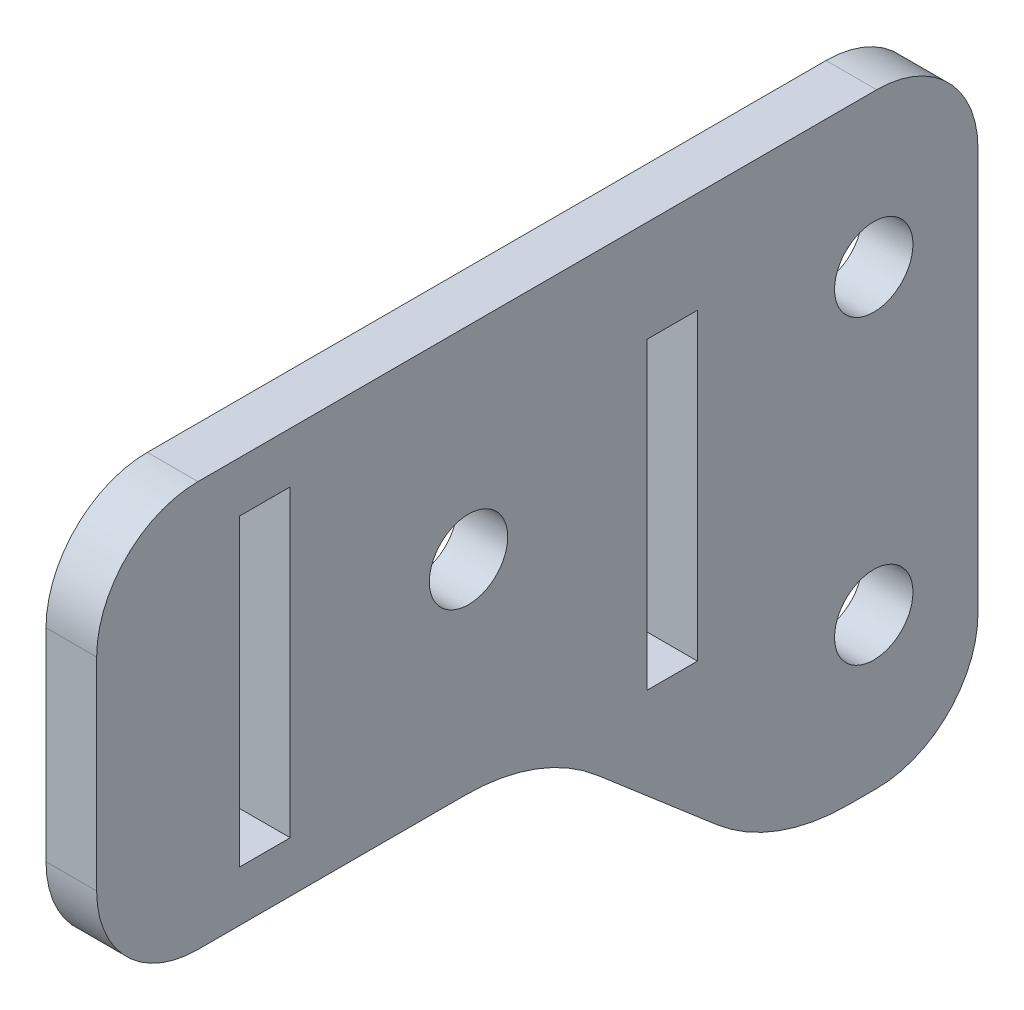
ISO-10303-21;
HEADER;
FILE_DESCRIPTION(('STEP AP214'),'2;1');
FILE_NAME('part.step','',(''),(''),'','','');
FILE_SCHEMA(('AUTOMOTIVE_DESIGN { 1 0 10303 214 1 1 1 1 }'));
ENDSEC;
DATA;
#1=APPLICATION_CONTEXT('core data for automotive mechanical design processes');
#2=APPLICATION_PROTOCOL_DEFINITION('international standard','automotive_design',2000,#1);
#3=PRODUCT_CONTEXT('',#1,'mechanical');
#4=PRODUCT('Part','Part','',(#3));
#5=PRODUCT_RELATED_PRODUCT_CATEGORY('part','',(#4));
#6=PRODUCT_DEFINITION_FORMATION('','',#4);
#7=PRODUCT_DEFINITION_CONTEXT('part definition',#1,'design');
#8=PRODUCT_DEFINITION('design','',#6,#7);
#9=PRODUCT_DEFINITION_SHAPE('','',#8);
#10=(LENGTH_UNIT() NAMED_UNIT(*) SI_UNIT(.MILLI.,.METRE.));
#11=(NAMED_UNIT(*) PLANE_ANGLE_UNIT() SI_UNIT($,.RADIAN.));
#12=(NAMED_UNIT(*) SI_UNIT($,.STERADIAN.) SOLID_ANGLE_UNIT());
#13=UNCERTAINTY_MEASURE_WITH_UNIT(LENGTH_MEASURE(1.E-05),#10,'distance_accuracy_value','');
#14=(GEOMETRIC_REPRESENTATION_CONTEXT(3) GLOBAL_UNCERTAINTY_ASSIGNED_CONTEXT((#13)) GLOBAL_UNIT_ASSIGNED_CONTEXT((#10,
#11,#12)) REPRESENTATION_CONTEXT('',''));
#15=CARTESIAN_POINT('',(0.,0.,0.));
#16=DIRECTION('',(0.,0.,1.));
#17=DIRECTION('',(1.,0.,0.));
#18=AXIS2_PLACEMENT_3D('',#15,#16,#17);
#19=CARTESIAN_POINT('',(3.175,17.2156788351446,-31.9348602919418));
#20=DIRECTION('',(0.,0.,1.));
#21=DIRECTION('',(0.,1.,0.));
#22=AXIS2_PLACEMENT_3D('',#19,#20,#21);
#23=PLANE('',#22);
#24=DIRECTION('',(0.,-1.,0.));
#25=VECTOR('',#24,1.);
#26=CARTESIAN_POINT('',(0.,17.2156788351446,-31.9348602919418));
#27=LINE('',#26,#25);
#28=CARTESIAN_POINT('',(0.,10.8656788351446,-31.9348602919418));
#29=VERTEX_POINT('',#28);
#30=CARTESIAN_POINT('',(0.,-14.3666811648554,-31.9348602919418));
#31=VERTEX_POINT('',#30);
#32=EDGE_CURVE('E218',#29,#31,#27,.T.);
#33=ORIENTED_EDGE('',*,*,#32,.F.);
#34=DIRECTION('',(-1.,0.,0.));
#35=VECTOR('',#34,1.);
#36=CARTESIAN_POINT('',(3.175,10.8656788351446,-31.9348602919418));
#37=LINE('',#36,#35);
#38=CARTESIAN_POINT('',(3.175,10.8656788351446,-31.9348602919418));
#39=VERTEX_POINT('',#38);
#40=EDGE_CURVE('E45',#39,#29,#37,.T.);
#41=ORIENTED_EDGE('',*,*,#40,.F.);
#42=DIRECTION('',(0.,-1.,0.));
#43=VECTOR('',#42,1.);
#44=CARTESIAN_POINT('',(3.175,17.2156788351446,-31.9348602919418));
#45=LINE('',#44,#43);
#46=CARTESIAN_POINT('',(3.175,-14.3666811648554,-31.9348602919418));
#47=VERTEX_POINT('',#46);
#48=EDGE_CURVE('E253',#39,#47,#45,.T.);
#49=ORIENTED_EDGE('',*,*,#48,.T.);
#50=DIRECTION('',(-1.,0.,0.));
#51=VECTOR('',#50,1.);
#52=CARTESIAN_POINT('',(3.175,-14.3666811648554,-31.9348602919418));
#53=LINE('',#52,#51);
#54=EDGE_CURVE('E11',#31,#47,#53,.F.);
#55=ORIENTED_EDGE('',*,*,#54,.F.);
#56=EDGE_LOOP('',(#33,#41,#49,#55));
#57=FACE_BOUND('',#56,.T.);
#58=ADVANCED_FACE('F37',(#57),#23,.F.);
#59=CARTESIAN_POINT('',(3.175,-20.7166811648554,-23.8154632165909));
#60=DIRECTION('',(0.,1.,0.));
#61=DIRECTION('',(0.,0.,-1.));
#62=AXIS2_PLACEMENT_3D('',#59,#60,#61);
#63=PLANE('',#62);
#64=DIRECTION('',(0.,0.,1.));
#65=VECTOR('',#64,1.);
#66=CARTESIAN_POINT('',(3.175,-20.7166811648554,-23.8154632165909));
#67=LINE('',#66,#65);
#68=CARTESIAN_POINT('',(3.175,-20.7166811648554,-25.5848602919418));
#69=VERTEX_POINT('',#68);
#70=CARTESIAN_POINT('',(3.175,-20.7166811648554,-23.8154632165909));
#71=VERTEX_POINT('',#70);
#72=EDGE_CURVE('E256',#69,#71,#67,.T.);
#73=ORIENTED_EDGE('',*,*,#72,.T.);
#74=DIRECTION('',(-1.,0.,0.));
#75=VECTOR('',#74,1.);
#76=CARTESIAN_POINT('',(3.175,-20.7166811648554,-23.8154632165909));
#77=LINE('',#76,#75);
#78=CARTESIAN_POINT('',(0.,-20.7166811648554,-23.8154632165909));
#79=VERTEX_POINT('',#78);
#80=EDGE_CURVE('E309',#71,#79,#77,.T.);
#81=ORIENTED_EDGE('',*,*,#80,.T.);
#82=DIRECTION('',(0.,0.,1.));
#83=VECTOR('',#82,1.);
#84=CARTESIAN_POINT('',(0.,-20.7166811648554,-23.8154632165909));
#85=LINE('',#84,#83);
#86=CARTESIAN_POINT('',(0.,-20.7166811648554,-25.5848602919418));
#87=VERTEX_POINT('',#86);
#88=EDGE_CURVE('E281',#87,#79,#85,.T.);
#89=ORIENTED_EDGE('',*,*,#88,.F.);
#90=DIRECTION('',(-1.,0.,0.));
#91=VECTOR('',#90,1.);
#92=CARTESIAN_POINT('',(3.175,-20.7166811648554,-25.5848602919418));
#93=LINE('',#92,#91);
#94=EDGE_CURVE('E340',#69,#87,#93,.T.);
#95=ORIENTED_EDGE('',*,*,#94,.F.);
#96=EDGE_LOOP('',(#73,#81,#89,#95));
#97=FACE_BOUND('',#96,.T.);
#98=ADVANCED_FACE('F360',(#97),#63,.F.);
#99=CARTESIAN_POINT('',(3.175,-8.01668116485543,-23.8154632165909));
#100=DIRECTION('',(-1.,0.,0.));
#101=DIRECTION('',(0.,0.,-1.));
#102=AXIS2_PLACEMENT_3D('',#99,#100,#101);
#103=CYLINDRICAL_SURFACE('',#102,12.7);
#104=CARTESIAN_POINT('',(0.,-8.01668116485543,-23.8154632165909));
#105=DIRECTION('',(-1.,0.,0.));
#106=DIRECTION('',(0.,0.,1.));
#107=AXIS2_PLACEMENT_3D('',#104,#105,#106);
#108=CIRCLE('',#107,12.7);
#109=CARTESIAN_POINT('',(0.,-17.6547424695242,-15.5451685248978));
#110=VERTEX_POINT('',#109);
#111=EDGE_CURVE('E284',#79,#110,#108,.T.);
#112=ORIENTED_EDGE('',*,*,#111,.F.);
#113=ORIENTED_EDGE('',*,*,#80,.F.);
#114=CARTESIAN_POINT('',(3.175,-8.01668116485543,-23.8154632165909));
#115=DIRECTION('',(-1.,0.,0.));
#116=DIRECTION('',(0.,0.,1.));
#117=AXIS2_PLACEMENT_3D('',#114,#115,#116);
#118=CIRCLE('',#117,12.7);
#119=CARTESIAN_POINT('',(3.175,-17.6547424695242,-15.5451685248978));
#120=VERTEX_POINT('',#119);
#121=EDGE_CURVE('E260',#71,#120,#118,.T.);
#122=ORIENTED_EDGE('',*,*,#121,.T.);
#123=DIRECTION('',(-1.,0.,0.));
#124=VECTOR('',#123,1.);
#125=CARTESIAN_POINT('',(3.175,-17.6547424695242,-15.5451685248978));
#126=LINE('',#125,#124);
#127=EDGE_CURVE('E306',#120,#110,#126,.T.);
#128=ORIENTED_EDGE('',*,*,#127,.T.);
#129=EDGE_LOOP('',(#112,#113,#122,#128));
#130=FACE_BOUND('',#129,.T.);
#131=ADVANCED_FACE('F363',(#130),#103,.T.);
#132=CARTESIAN_POINT('',(3.175,-11.2462598601867,-8.07683147510241));
#133=DIRECTION('',(0.,0.758902464934545,-0.651204306432529));
#134=DIRECTION('',(0.,-0.651204306432529,-0.758902464934545));
#135=AXIS2_PLACEMENT_3D('',#132,#133,#134);
#136=PLANE('',#135);
#137=DIRECTION('',(0.,0.651204306432529,0.758902464934545));
#138=VECTOR('',#137,1.);
#139=CARTESIAN_POINT('',(0.,-11.2462598601867,-8.07683147510241));
#140=LINE('',#139,#138);
#141=CARTESIAN_POINT('',(0.,-11.2462598601867,-8.07683147510241));
#142=VERTEX_POINT('',#141);
#143=EDGE_CURVE('E287',#110,#142,#140,.T.);
#144=ORIENTED_EDGE('',*,*,#143,.F.);
#145=ORIENTED_EDGE('',*,*,#127,.F.);
#146=DIRECTION('',(0.,0.651204306432529,0.758902464934545));
#147=VECTOR('',#146,1.);
#148=CARTESIAN_POINT('',(3.175,-11.2462598601867,-8.07683147510241));
#149=LINE('',#148,#147);
#150=CARTESIAN_POINT('',(3.175,-11.2462598601867,-8.07683147510241));
#151=VERTEX_POINT('',#150);
#152=EDGE_CURVE('E263',#120,#151,#149,.T.);
#153=ORIENTED_EDGE('',*,*,#152,.T.);
#154=DIRECTION('',(-1.,0.,0.));
#155=VECTOR('',#154,1.);
#156=CARTESIAN_POINT('',(3.175,-11.2462598601867,-8.07683147510241));
#157=LINE('',#156,#155);
#158=EDGE_CURVE('E303',#151,#142,#157,.T.);
#159=ORIENTED_EDGE('',*,*,#158,.T.);
#160=EDGE_LOOP('',(#144,#145,#153,#159));
#161=FACE_BOUND('',#160,.T.);
#162=ADVANCED_FACE('F366',(#161),#136,.F.);
#163=CARTESIAN_POINT('',(3.175,-20.8843211648554,0.193463216590709));
#164=DIRECTION('',(-1.,0.,0.));
#165=DIRECTION('',(0.,0.,-1.));
#166=AXIS2_PLACEMENT_3D('',#163,#164,#165);
#167=CYLINDRICAL_SURFACE('',#166,12.7);
#168=CARTESIAN_POINT('',(0.,-20.8843211648554,0.193463216590709));
#169=DIRECTION('',(1.,0.,0.));
#170=DIRECTION('',(0.,0.,1.));
#171=AXIS2_PLACEMENT_3D('',#168,#169,#170);
#172=CIRCLE('',#171,12.7);
#173=CARTESIAN_POINT('',(0.,-8.18432116485543,0.193463216590736));
#174=VERTEX_POINT('',#173);
#175=EDGE_CURVE('E290',#142,#174,#172,.T.);
#176=ORIENTED_EDGE('',*,*,#175,.F.);
#177=ORIENTED_EDGE('',*,*,#158,.F.);
#178=CARTESIAN_POINT('',(3.175,-20.8843211648554,0.193463216590709));
#179=DIRECTION('',(1.,0.,0.));
#180=DIRECTION('',(0.,0.,1.));
#181=AXIS2_PLACEMENT_3D('',#178,#179,#180);
#182=CIRCLE('',#181,12.7);
#183=CARTESIAN_POINT('',(3.175,-8.18432116485543,0.193463216590736));
#184=VERTEX_POINT('',#183);
#185=EDGE_CURVE('E266',#151,#184,#182,.T.);
#186=ORIENTED_EDGE('',*,*,#185,.T.);
#187=DIRECTION('',(-1.,0.,0.));
#188=VECTOR('',#187,1.);
#189=CARTESIAN_POINT('',(3.175,-8.18432116485543,0.193463216590736));
#190=LINE('',#189,#188);
#191=EDGE_CURVE('E278',#184,#174,#190,.T.);
#192=ORIENTED_EDGE('',*,*,#191,.T.);
#193=EDGE_LOOP('',(#176,#177,#186,#192));
#194=FACE_BOUND('',#193,.T.);
#195=ADVANCED_FACE('F369',(#194),#167,.F.);
#196=CARTESIAN_POINT('',(3.175,-8.18432116485543,23.3101397080582));
#197=DIRECTION('',(0.,1.,0.));
#198=DIRECTION('',(0.,0.,-1.));
#199=AXIS2_PLACEMENT_3D('',#196,#197,#198);
#200=PLANE('',#199);
#201=DIRECTION('',(0.,0.,1.));
#202=VECTOR('',#201,1.);
#203=CARTESIAN_POINT('',(0.,-8.18432116485543,23.3101397080582));
#204=LINE('',#203,#202);
#205=CARTESIAN_POINT('',(0.,-8.18432116485543,16.9601397080582));
#206=VERTEX_POINT('',#205);
#207=EDGE_CURVE('E293',#174,#206,#204,.T.);
#208=ORIENTED_EDGE('',*,*,#207,.F.);
#209=ORIENTED_EDGE('',*,*,#191,.F.);
#210=DIRECTION('',(0.,0.,1.));
#211=VECTOR('',#210,1.);
#212=CARTESIAN_POINT('',(3.175,-8.18432116485543,23.3101397080582));
#213=LINE('',#212,#211);
#214=CARTESIAN_POINT('',(3.175,-8.18432116485543,16.9601397080582));
#215=VERTEX_POINT('',#214);
#216=EDGE_CURVE('E269',#184,#215,#213,.T.);
#217=ORIENTED_EDGE('',*,*,#216,.T.);
#218=DIRECTION('',(-1.,0.,0.));
#219=VECTOR('',#218,1.);
#220=CARTESIAN_POINT('',(3.175,-8.18432116485543,16.9601397080582));
#221=LINE('',#220,#219);
#222=EDGE_CURVE('E338',#206,#215,#221,.F.);
#223=ORIENTED_EDGE('',*,*,#222,.F.);
#224=EDGE_LOOP('',(#208,#209,#217,#223));
#225=FACE_BOUND('',#224,.T.);
#226=ADVANCED_FACE('F373',(#225),#200,.F.);
#227=CARTESIAN_POINT('',(3.175,-8.18432116485543,23.3101397080582));
#228=DIRECTION('',(0.,0.,-1.));
#229=DIRECTION('',(1.,0.,0.));
#230=AXIS2_PLACEMENT_3D('',#227,#228,#229);
#231=PLANE('',#230);
#232=DIRECTION('',(0.,1.,0.));
#233=VECTOR('',#232,1.);
#234=CARTESIAN_POINT('',(0.,-8.18432116485543,23.3101397080582));
#235=LINE('',#234,#233);
#236=CARTESIAN_POINT('',(0.,-1.83432116485543,23.3101397080582));
#237=VERTEX_POINT('',#236);
#238=CARTESIAN_POINT('',(0.,10.8656788351446,23.3101397080582));
#239=VERTEX_POINT('',#238);
#240=EDGE_CURVE('E296',#237,#239,#235,.T.);
#241=ORIENTED_EDGE('',*,*,#240,.F.);
#242=DIRECTION('',(-1.,0.,0.));
#243=VECTOR('',#242,1.);
#244=CARTESIAN_POINT('',(3.175,-1.83432116485543,23.3101397080582));
#245=LINE('',#244,#243);
#246=CARTESIAN_POINT('',(3.175,-1.83432116485543,23.3101397080582));
#247=VERTEX_POINT('',#246);
#248=EDGE_CURVE('E326',#247,#237,#245,.T.);
#249=ORIENTED_EDGE('',*,*,#248,.F.);
#250=DIRECTION('',(0.,1.,0.));
#251=VECTOR('',#250,1.);
#252=CARTESIAN_POINT('',(3.175,-8.18432116485543,23.3101397080582));
#253=LINE('',#252,#251);
#254=CARTESIAN_POINT('',(3.175,10.8656788351446,23.3101397080582));
#255=VERTEX_POINT('',#254);
#256=EDGE_CURVE('E272',#247,#255,#253,.T.);
#257=ORIENTED_EDGE('',*,*,#256,.T.);
#258=DIRECTION('',(-1.,0.,0.));
#259=VECTOR('',#258,1.);
#260=CARTESIAN_POINT('',(3.175,10.8656788351446,23.3101397080582));
#261=LINE('',#260,#259);
#262=EDGE_CURVE('E329',#239,#255,#261,.F.);
#263=ORIENTED_EDGE('',*,*,#262,.F.);
#264=EDGE_LOOP('',(#241,#249,#257,#263));
#265=FACE_BOUND('',#264,.T.);
#266=ADVANCED_FACE('F380',(#265),#231,.F.);
#267=CARTESIAN_POINT('',(3.175,17.2156788351446,-31.9348602919418));
#268=DIRECTION('',(0.,-1.,0.));
#269=DIRECTION('',(0.,0.,1.));
#270=AXIS2_PLACEMENT_3D('',#267,#268,#269);
#271=PLANE('',#270);
#272=DIRECTION('',(0.,0.,-1.));
#273=VECTOR('',#272,1.);
#274=CARTESIAN_POINT('',(3.175,17.2156788351446,-31.9348602919418));
#275=LINE('',#274,#273);
#276=CARTESIAN_POINT('',(3.175,17.2156788351446,16.9601397080582));
#277=VERTEX_POINT('',#276);
#278=CARTESIAN_POINT('',(3.175,17.2156788351446,-25.5848602919418));
#279=VERTEX_POINT('',#278);
#280=EDGE_CURVE('E275',#277,#279,#275,.T.);
#281=ORIENTED_EDGE('',*,*,#280,.T.);
#282=DIRECTION('',(-1.,0.,0.));
#283=VECTOR('',#282,1.);
#284=CARTESIAN_POINT('',(3.175,17.2156788351446,-25.5848602919418));
#285=LINE('',#284,#283);
#286=CARTESIAN_POINT('',(0.,17.2156788351446,-25.5848602919418));
#287=VERTEX_POINT('',#286);
#288=EDGE_CURVE('E312',#287,#279,#285,.F.);
#289=ORIENTED_EDGE('',*,*,#288,.F.);
#290=DIRECTION('',(0.,0.,-1.));
#291=VECTOR('',#290,1.);
#292=CARTESIAN_POINT('',(0.,17.2156788351446,-31.9348602919418));
#293=LINE('',#292,#291);
#294=CARTESIAN_POINT('',(0.,17.2156788351446,16.9601397080582));
#295=VERTEX_POINT('',#294);
#296=EDGE_CURVE('E257',#295,#287,#293,.T.);
#297=ORIENTED_EDGE('',*,*,#296,.F.);
#298=DIRECTION('',(-1.,0.,0.));
#299=VECTOR('',#298,1.);
#300=CARTESIAN_POINT('',(3.175,17.2156788351446,16.9601397080582));
#301=LINE('',#300,#299);
#302=EDGE_CURVE('E315',#277,#295,#301,.T.);
#303=ORIENTED_EDGE('',*,*,#302,.F.);
#304=EDGE_LOOP('',(#281,#289,#297,#303));
#305=FACE_BOUND('',#304,.T.);
#306=ADVANCED_FACE('F354',(#305),#271,.F.);
#307=CARTESIAN_POINT('',(3.175,-8.01668116485543,-23.8154632165909));
#308=DIRECTION('',(1.,0.,0.));
#309=DIRECTION('',(0.,0.,1.));
#310=AXIS2_PLACEMENT_3D('',#307,#308,#309);
#311=PLANE('',#310);
#312=CARTESIAN_POINT('',(3.175,7.69067883514458,-25.4));
#313=DIRECTION('',(-1.,0.,0.));
#314=DIRECTION('',(0.,0.,1.));
#315=AXIS2_PLACEMENT_3D('',#312,#313,#314);
#316=CIRCLE('',#315,2.45744999999999);
#317=CARTESIAN_POINT('',(3.175,7.69067883514458,-22.94255));
#318=VERTEX_POINT('',#317);
#319=EDGE_CURVE('E463',#318,#318,#316,.T.);
#320=ORIENTED_EDGE('',*,*,#319,.T.);
#321=EDGE_LOOP('',(#320));
#322=FACE_BOUND('',#321,.T.);
#323=CARTESIAN_POINT('',(3.175,-11.1916811648554,-25.4));
#324=DIRECTION('',(-1.,0.,0.));
#325=DIRECTION('',(0.,0.,1.));
#326=AXIS2_PLACEMENT_3D('',#323,#324,#325);
#327=CIRCLE('',#326,2.45744999999999);
#328=CARTESIAN_POINT('',(3.175,-11.1916811648554,-22.94255));
#329=VERTEX_POINT('',#328);
#330=EDGE_CURVE('E458',#329,#329,#327,.T.);
#331=ORIENTED_EDGE('',*,*,#330,.T.);
#332=EDGE_LOOP('',(#331));
#333=FACE_BOUND('',#332,.T.);
#334=CARTESIAN_POINT('',(3.175,4.51567883514458,0.));
#335=DIRECTION('',(-1.,0.,0.));
#336=DIRECTION('',(0.,0.,1.));
#337=AXIS2_PLACEMENT_3D('',#334,#335,#336);
#338=CIRCLE('',#337,2.45744999999999);
#339=CARTESIAN_POINT('',(3.175,4.51567883514458,2.45744999999999));
#340=VERTEX_POINT('',#339);
#341=EDGE_CURVE('E206',#340,#340,#338,.T.);
#342=ORIENTED_EDGE('',*,*,#341,.T.);
#343=EDGE_LOOP('',(#342));
#344=FACE_BOUND('',#343,.T.);
#345=DIRECTION('',(0.,1.,0.));
#346=VECTOR('',#345,1.);
#347=CARTESIAN_POINT('',(3.175,14.0406788351446,11.176));
#348=LINE('',#347,#346);
#349=CARTESIAN_POINT('',(3.175,-5.00932116485543,11.176));
#350=VERTEX_POINT('',#349);
#351=CARTESIAN_POINT('',(3.175,14.0406788351446,11.176));
#352=VERTEX_POINT('',#351);
#353=EDGE_CURVE('E193',#350,#352,#348,.T.);
#354=ORIENTED_EDGE('',*,*,#353,.F.);
#355=DIRECTION('',(0.,0.,-1.));
#356=VECTOR('',#355,1.);
#357=CARTESIAN_POINT('',(3.175,-5.00932116485543,11.176));
#358=LINE('',#357,#356);
#359=CARTESIAN_POINT('',(3.175,-5.00932116485543,14.351));
#360=VERTEX_POINT('',#359);
#361=EDGE_CURVE('E186',#360,#350,#358,.T.);
#362=ORIENTED_EDGE('',*,*,#361,.F.);
#363=DIRECTION('',(0.,-1.,0.));
#364=VECTOR('',#363,1.);
#365=CARTESIAN_POINT('',(3.175,-5.00932116485543,14.351));
#366=LINE('',#365,#364);
#367=CARTESIAN_POINT('',(3.175,14.0406788351446,14.351));
#368=VERTEX_POINT('',#367);
#369=EDGE_CURVE('E195',#368,#360,#366,.T.);
#370=ORIENTED_EDGE('',*,*,#369,.F.);
#371=DIRECTION('',(0.,0.,1.));
#372=VECTOR('',#371,1.);
#373=CARTESIAN_POINT('',(3.175,14.0406788351446,11.176));
#374=LINE('',#373,#372);
#375=EDGE_CURVE('E177',#352,#368,#374,.T.);
#376=ORIENTED_EDGE('',*,*,#375,.F.);
#377=EDGE_LOOP('',(#354,#362,#370,#376));
#378=FACE_BOUND('',#377,.T.);
#379=DIRECTION('',(0.,1.,0.));
#380=VECTOR('',#379,1.);
#381=CARTESIAN_POINT('',(3.175,-8.18432116485535,-14.351));
#382=LINE('',#381,#380);
#383=CARTESIAN_POINT('',(3.175,-8.18432116485535,-14.351));
#384=VERTEX_POINT('',#383);
#385=CARTESIAN_POINT('',(3.175,10.8656788351446,-14.351));
#386=VERTEX_POINT('',#385);
#387=EDGE_CURVE('E222',#384,#386,#382,.T.);
#388=ORIENTED_EDGE('',*,*,#387,.F.);
#389=DIRECTION('',(0.,0.,-1.));
#390=VECTOR('',#389,1.);
#391=CARTESIAN_POINT('',(3.175,-8.18432116485535,-11.176));
#392=LINE('',#391,#390);
#393=CARTESIAN_POINT('',(3.175,-8.18432116485535,-11.176));
#394=VERTEX_POINT('',#393);
#395=EDGE_CURVE('E232',#394,#384,#392,.T.);
#396=ORIENTED_EDGE('',*,*,#395,.F.);
#397=DIRECTION('',(0.,-1.,0.));
#398=VECTOR('',#397,1.);
#399=CARTESIAN_POINT('',(3.175,10.8656788351446,-11.176));
#400=LINE('',#399,#398);
#401=CARTESIAN_POINT('',(3.175,10.8656788351446,-11.176));
#402=VERTEX_POINT('',#401);
#403=EDGE_CURVE('E229',#402,#394,#400,.T.);
#404=ORIENTED_EDGE('',*,*,#403,.F.);
#405=DIRECTION('',(0.,0.,1.));
#406=VECTOR('',#405,1.);
#407=CARTESIAN_POINT('',(3.175,10.8656788351446,-14.351));
#408=LINE('',#407,#406);
#409=EDGE_CURVE('E225',#386,#402,#408,.T.);
#410=ORIENTED_EDGE('',*,*,#409,.F.);
#411=EDGE_LOOP('',(#388,#396,#404,#410));
#412=FACE_BOUND('',#411,.T.);
#413=ORIENTED_EDGE('',*,*,#256,.F.);
#414=CARTESIAN_POINT('',(3.175,-1.83432116485543,16.9601397080582));
#415=DIRECTION('',(-1.,0.,0.));
#416=DIRECTION('',(0.,0.,1.));
#417=AXIS2_PLACEMENT_3D('',#414,#415,#416);
#418=CIRCLE('',#417,6.35);
#419=EDGE_CURVE('E52',#215,#247,#418,.T.);
#420=ORIENTED_EDGE('',*,*,#419,.F.);
#421=ORIENTED_EDGE('',*,*,#216,.F.);
#422=ORIENTED_EDGE('',*,*,#185,.F.);
#423=ORIENTED_EDGE('',*,*,#152,.F.);
#424=ORIENTED_EDGE('',*,*,#121,.F.);
#425=ORIENTED_EDGE('',*,*,#72,.F.);
#426=CARTESIAN_POINT('',(3.175,-14.3666811648554,-25.5848602919418));
#427=DIRECTION('',(-1.,0.,0.));
#428=DIRECTION('',(0.,0.,1.));
#429=AXIS2_PLACEMENT_3D('',#426,#427,#428);
#430=CIRCLE('',#429,6.35);
#431=EDGE_CURVE('E59',#47,#69,#430,.T.);
#432=ORIENTED_EDGE('',*,*,#431,.F.);
#433=ORIENTED_EDGE('',*,*,#48,.F.);
#434=CARTESIAN_POINT('',(3.175,10.8656788351446,-25.5848602919418));
#435=DIRECTION('',(-1.,0.,0.));
#436=DIRECTION('',(0.,0.,1.));
#437=AXIS2_PLACEMENT_3D('',#434,#435,#436);
#438=CIRCLE('',#437,6.35);
#439=EDGE_CURVE('E332',#279,#39,#438,.T.);
#440=ORIENTED_EDGE('',*,*,#439,.F.);
#441=ORIENTED_EDGE('',*,*,#280,.F.);
#442=CARTESIAN_POINT('',(3.175,10.8656788351446,16.9601397080582));
#443=DIRECTION('',(-1.,0.,0.));
#444=DIRECTION('',(0.,0.,1.));
#445=AXIS2_PLACEMENT_3D('',#442,#443,#444);
#446=CIRCLE('',#445,6.35);
#447=EDGE_CURVE('E336',#255,#277,#446,.T.);
#448=ORIENTED_EDGE('',*,*,#447,.F.);
#449=EDGE_LOOP('',(#413,#420,#421,#422,#423,#424,#425,#432,#433,#440,#441,#448));
#450=FACE_BOUND('',#449,.T.);
#451=ADVANCED_FACE('F190',(#322,#333,#344,#378,#412,#450),#311,.T.);
#452=CARTESIAN_POINT('',(0.,-8.01668116485543,-23.8154632165909));
#453=DIRECTION('',(1.,0.,0.));
#454=DIRECTION('',(0.,0.,1.));
#455=AXIS2_PLACEMENT_3D('',#452,#453,#454);
#456=PLANE('',#455);
#457=CARTESIAN_POINT('',(0.,7.69067883514458,-25.4));
#458=DIRECTION('',(1.,0.,0.));
#459=DIRECTION('',(0.,0.,-1.));
#460=AXIS2_PLACEMENT_3D('',#457,#458,#459);
#461=CIRCLE('',#460,2.45744999999999);
#462=CARTESIAN_POINT('',(0.,7.69067883514458,-27.85745));
#463=VERTEX_POINT('',#462);
#464=EDGE_CURVE('E468',#463,#463,#461,.T.);
#465=ORIENTED_EDGE('',*,*,#464,.T.);
#466=EDGE_LOOP('',(#465));
#467=FACE_BOUND('',#466,.T.);
#468=CARTESIAN_POINT('',(0.,-11.1916811648554,-25.4));
#469=DIRECTION('',(1.,0.,0.));
#470=DIRECTION('',(0.,0.,-1.));
#471=AXIS2_PLACEMENT_3D('',#468,#469,#470);
#472=CIRCLE('',#471,2.45744999999999);
#473=CARTESIAN_POINT('',(0.,-11.1916811648554,-27.85745));
#474=VERTEX_POINT('',#473);
#475=EDGE_CURVE('E461',#474,#474,#472,.T.);
#476=ORIENTED_EDGE('',*,*,#475,.T.);
#477=EDGE_LOOP('',(#476));
#478=FACE_BOUND('',#477,.T.);
#479=CARTESIAN_POINT('',(0.,4.51567883514458,0.));
#480=DIRECTION('',(1.,0.,0.));
#481=DIRECTION('',(0.,0.,-1.));
#482=AXIS2_PLACEMENT_3D('',#479,#480,#481);
#483=CIRCLE('',#482,2.45744999999999);
#484=CARTESIAN_POINT('',(0.,4.51567883514458,-2.45744999999999));
#485=VERTEX_POINT('',#484);
#486=EDGE_CURVE('E465',#485,#485,#483,.T.);
#487=ORIENTED_EDGE('',*,*,#486,.T.);
#488=EDGE_LOOP('',(#487));
#489=FACE_BOUND('',#488,.T.);
#490=DIRECTION('',(0.,0.,1.));
#491=VECTOR('',#490,1.);
#492=CARTESIAN_POINT('',(0.,14.0406788351446,11.176));
#493=LINE('',#492,#491);
#494=CARTESIAN_POINT('',(0.,14.0406788351446,11.176));
#495=VERTEX_POINT('',#494);
#496=CARTESIAN_POINT('',(0.,14.0406788351446,14.351));
#497=VERTEX_POINT('',#496);
#498=EDGE_CURVE('E180',#495,#497,#493,.T.);
#499=ORIENTED_EDGE('',*,*,#498,.T.);
#500=DIRECTION('',(0.,-1.,0.));
#501=VECTOR('',#500,1.);
#502=CARTESIAN_POINT('',(0.,-5.00932116485543,14.351));
#503=LINE('',#502,#501);
#504=CARTESIAN_POINT('',(0.,-5.00932116485543,14.351));
#505=VERTEX_POINT('',#504);
#506=EDGE_CURVE('E203',#497,#505,#503,.T.);
#507=ORIENTED_EDGE('',*,*,#506,.T.);
#508=DIRECTION('',(0.,0.,-1.));
#509=VECTOR('',#508,1.);
#510=CARTESIAN_POINT('',(0.,-5.00932116485543,11.176));
#511=LINE('',#510,#509);
#512=CARTESIAN_POINT('',(0.,-5.00932116485543,11.176));
#513=VERTEX_POINT('',#512);
#514=EDGE_CURVE('E200',#505,#513,#511,.T.);
#515=ORIENTED_EDGE('',*,*,#514,.T.);
#516=DIRECTION('',(0.,1.,0.));
#517=VECTOR('',#516,1.);
#518=CARTESIAN_POINT('',(0.,14.0406788351446,11.176));
#519=LINE('',#518,#517);
#520=EDGE_CURVE('E211',#513,#495,#519,.T.);
#521=ORIENTED_EDGE('',*,*,#520,.T.);
#522=EDGE_LOOP('',(#499,#507,#515,#521));
#523=FACE_BOUND('',#522,.T.);
#524=DIRECTION('',(0.,0.,1.));
#525=VECTOR('',#524,1.);
#526=CARTESIAN_POINT('',(0.,10.8656788351446,-14.351));
#527=LINE('',#526,#525);
#528=CARTESIAN_POINT('',(0.,10.8656788351446,-14.351));
#529=VERTEX_POINT('',#528);
#530=CARTESIAN_POINT('',(0.,10.8656788351446,-11.176));
#531=VERTEX_POINT('',#530);
#532=EDGE_CURVE('E239',#529,#531,#527,.T.);
#533=ORIENTED_EDGE('',*,*,#532,.T.);
#534=DIRECTION('',(0.,-1.,0.));
#535=VECTOR('',#534,1.);
#536=CARTESIAN_POINT('',(0.,10.8656788351446,-11.176));
#537=LINE('',#536,#535);
#538=CARTESIAN_POINT('',(0.,-8.18432116485535,-11.176));
#539=VERTEX_POINT('',#538);
#540=EDGE_CURVE('E242',#531,#539,#537,.T.);
#541=ORIENTED_EDGE('',*,*,#540,.T.);
#542=DIRECTION('',(0.,0.,-1.));
#543=VECTOR('',#542,1.);
#544=CARTESIAN_POINT('',(0.,-8.18432116485535,-11.176));
#545=LINE('',#544,#543);
#546=CARTESIAN_POINT('',(0.,-8.18432116485535,-14.351));
#547=VERTEX_POINT('',#546);
#548=EDGE_CURVE('E226',#539,#547,#545,.T.);
#549=ORIENTED_EDGE('',*,*,#548,.T.);
#550=DIRECTION('',(0.,1.,0.));
#551=VECTOR('',#550,1.);
#552=CARTESIAN_POINT('',(0.,-8.18432116485535,-14.351));
#553=LINE('',#552,#551);
#554=EDGE_CURVE('E236',#547,#529,#553,.T.);
#555=ORIENTED_EDGE('',*,*,#554,.T.);
#556=EDGE_LOOP('',(#533,#541,#549,#555));
#557=FACE_BOUND('',#556,.T.);
#558=ORIENTED_EDGE('',*,*,#296,.T.);
#559=CARTESIAN_POINT('',(0.,10.8656788351446,-25.5848602919418));
#560=DIRECTION('',(-1.,0.,0.));
#561=DIRECTION('',(0.,0.,1.));
#562=AXIS2_PLACEMENT_3D('',#559,#560,#561);
#563=CIRCLE('',#562,6.35);
#564=EDGE_CURVE('E318',#29,#287,#563,.F.);
#565=ORIENTED_EDGE('',*,*,#564,.F.);
#566=ORIENTED_EDGE('',*,*,#32,.T.);
#567=CARTESIAN_POINT('',(0.,-14.3666811648554,-25.5848602919418));
#568=DIRECTION('',(-1.,0.,0.));
#569=DIRECTION('',(0.,0.,1.));
#570=AXIS2_PLACEMENT_3D('',#567,#568,#569);
#571=CIRCLE('',#570,6.35);
#572=EDGE_CURVE('E320',#87,#31,#571,.F.);
#573=ORIENTED_EDGE('',*,*,#572,.F.);
#574=ORIENTED_EDGE('',*,*,#88,.T.);
#575=ORIENTED_EDGE('',*,*,#111,.T.);
#576=ORIENTED_EDGE('',*,*,#143,.T.);
#577=ORIENTED_EDGE('',*,*,#175,.T.);
#578=ORIENTED_EDGE('',*,*,#207,.T.);
#579=CARTESIAN_POINT('',(0.,-1.83432116485543,16.9601397080582));
#580=DIRECTION('',(-1.,0.,0.));
#581=DIRECTION('',(0.,0.,1.));
#582=AXIS2_PLACEMENT_3D('',#579,#580,#581);
#583=CIRCLE('',#582,6.35);
#584=EDGE_CURVE('E322',#237,#206,#583,.F.);
#585=ORIENTED_EDGE('',*,*,#584,.F.);
#586=ORIENTED_EDGE('',*,*,#240,.T.);
#587=CARTESIAN_POINT('',(0.,10.8656788351446,16.9601397080582));
#588=DIRECTION('',(-1.,0.,0.));
#589=DIRECTION('',(0.,0.,1.));
#590=AXIS2_PLACEMENT_3D('',#587,#588,#589);
#591=CIRCLE('',#590,6.35);
#592=EDGE_CURVE('E324',#295,#239,#591,.F.);
#593=ORIENTED_EDGE('',*,*,#592,.F.);
#594=EDGE_LOOP('',(#558,#565,#566,#573,#574,#575,#576,#577,#578,#585,#586,#593));
#595=FACE_BOUND('',#594,.T.);
#596=ADVANCED_FACE('F349',(#467,#478,#489,#523,#557,#595),#456,.F.);
#597=CARTESIAN_POINT('',(3.175,-8.18432116485535,-14.351));
#598=DIRECTION('',(0.,0.,-1.));
#599=DIRECTION('',(0.,-1.,0.));
#600=AXIS2_PLACEMENT_3D('',#597,#598,#599);
#601=PLANE('',#600);
#602=ORIENTED_EDGE('',*,*,#554,.F.);
#603=DIRECTION('',(-1.,0.,0.));
#604=VECTOR('',#603,1.);
#605=CARTESIAN_POINT('',(3.175,-8.18432116485535,-14.351));
#606=LINE('',#605,#604);
#607=EDGE_CURVE('E213',#384,#547,#606,.T.);
#608=ORIENTED_EDGE('',*,*,#607,.F.);
#609=ORIENTED_EDGE('',*,*,#387,.T.);
#610=DIRECTION('',(-1.,0.,0.));
#611=VECTOR('',#610,1.);
#612=CARTESIAN_POINT('',(3.175,10.8656788351446,-14.351));
#613=LINE('',#612,#611);
#614=EDGE_CURVE('E235',#386,#529,#613,.T.);
#615=ORIENTED_EDGE('',*,*,#614,.T.);
#616=EDGE_LOOP('',(#602,#608,#609,#615));
#617=FACE_BOUND('',#616,.T.);
#618=ADVANCED_FACE('F415',(#617),#601,.F.);
#619=CARTESIAN_POINT('',(3.175,-8.18432116485535,-11.176));
#620=DIRECTION('',(0.,-1.,0.));
#621=DIRECTION('',(0.,0.,1.));
#622=AXIS2_PLACEMENT_3D('',#619,#620,#621);
#623=PLANE('',#622);
#624=ORIENTED_EDGE('',*,*,#548,.F.);
#625=DIRECTION('',(-1.,0.,0.));
#626=VECTOR('',#625,1.);
#627=CARTESIAN_POINT('',(3.175,-8.18432116485535,-11.176));
#628=LINE('',#627,#626);
#629=EDGE_CURVE('E248',#394,#539,#628,.T.);
#630=ORIENTED_EDGE('',*,*,#629,.F.);
#631=ORIENTED_EDGE('',*,*,#395,.T.);
#632=ORIENTED_EDGE('',*,*,#607,.T.);
#633=EDGE_LOOP('',(#624,#630,#631,#632));
#634=FACE_BOUND('',#633,.T.);
#635=ADVANCED_FACE('F422',(#634),#623,.F.);
#636=CARTESIAN_POINT('',(3.175,10.8656788351446,-11.176));
#637=DIRECTION('',(0.,0.,1.));
#638=DIRECTION('',(0.,1.,0.));
#639=AXIS2_PLACEMENT_3D('',#636,#637,#638);
#640=PLANE('',#639);
#641=ORIENTED_EDGE('',*,*,#540,.F.);
#642=DIRECTION('',(-1.,0.,0.));
#643=VECTOR('',#642,1.);
#644=CARTESIAN_POINT('',(3.175,10.8656788351446,-11.176));
#645=LINE('',#644,#643);
#646=EDGE_CURVE('E250',#402,#531,#645,.T.);
#647=ORIENTED_EDGE('',*,*,#646,.F.);
#648=ORIENTED_EDGE('',*,*,#403,.T.);
#649=ORIENTED_EDGE('',*,*,#629,.T.);
#650=EDGE_LOOP('',(#641,#647,#648,#649));
#651=FACE_BOUND('',#650,.T.);
#652=ADVANCED_FACE('F427',(#651),#640,.F.);
#653=CARTESIAN_POINT('',(3.175,10.8656788351446,-14.351));
#654=DIRECTION('',(0.,1.,0.));
#655=DIRECTION('',(0.,0.,-1.));
#656=AXIS2_PLACEMENT_3D('',#653,#654,#655);
#657=PLANE('',#656);
#658=ORIENTED_EDGE('',*,*,#532,.F.);
#659=ORIENTED_EDGE('',*,*,#614,.F.);
#660=ORIENTED_EDGE('',*,*,#409,.T.);
#661=ORIENTED_EDGE('',*,*,#646,.T.);
#662=EDGE_LOOP('',(#658,#659,#660,#661));
#663=FACE_BOUND('',#662,.T.);
#664=ADVANCED_FACE('F424',(#663),#657,.F.);
#665=CARTESIAN_POINT('',(3.175,14.0406788351446,11.176));
#666=DIRECTION('',(0.,0.,-1.));
#667=DIRECTION('',(0.,-1.,0.));
#668=AXIS2_PLACEMENT_3D('',#665,#666,#667);
#669=PLANE('',#668);
#670=ORIENTED_EDGE('',*,*,#520,.F.);
#671=DIRECTION('',(-1.,0.,0.));
#672=VECTOR('',#671,1.);
#673=CARTESIAN_POINT('',(3.175,-5.00932116485543,11.176));
#674=LINE('',#673,#672);
#675=EDGE_CURVE('E198',#350,#513,#674,.T.);
#676=ORIENTED_EDGE('',*,*,#675,.F.);
#677=ORIENTED_EDGE('',*,*,#353,.T.);
#678=DIRECTION('',(-1.,0.,0.));
#679=VECTOR('',#678,1.);
#680=CARTESIAN_POINT('',(3.175,14.0406788351446,11.176));
#681=LINE('',#680,#679);
#682=EDGE_CURVE('E174',#352,#495,#681,.T.);
#683=ORIENTED_EDGE('',*,*,#682,.T.);
#684=EDGE_LOOP('',(#670,#676,#677,#683));
#685=FACE_BOUND('',#684,.T.);
#686=ADVANCED_FACE('F197',(#685),#669,.F.);
#687=CARTESIAN_POINT('',(3.175,-5.00932116485543,11.176));
#688=DIRECTION('',(0.,-1.,0.));
#689=DIRECTION('',(0.,0.,1.));
#690=AXIS2_PLACEMENT_3D('',#687,#688,#689);
#691=PLANE('',#690);
#692=ORIENTED_EDGE('',*,*,#514,.F.);
#693=DIRECTION('',(-1.,0.,0.));
#694=VECTOR('',#693,1.);
#695=CARTESIAN_POINT('',(3.175,-5.00932116485543,14.351));
#696=LINE('',#695,#694);
#697=EDGE_CURVE('E219',#360,#505,#696,.T.);
#698=ORIENTED_EDGE('',*,*,#697,.F.);
#699=ORIENTED_EDGE('',*,*,#361,.T.);
#700=ORIENTED_EDGE('',*,*,#675,.T.);
#701=EDGE_LOOP('',(#692,#698,#699,#700));
#702=FACE_BOUND('',#701,.T.);
#703=ADVANCED_FACE('F437',(#702),#691,.F.);
#704=CARTESIAN_POINT('',(3.175,-5.00932116485543,14.351));
#705=DIRECTION('',(0.,0.,1.));
#706=DIRECTION('',(-1.,0.,0.));
#707=AXIS2_PLACEMENT_3D('',#704,#705,#706);
#708=PLANE('',#707);
#709=ORIENTED_EDGE('',*,*,#506,.F.);
#710=DIRECTION('',(-1.,0.,0.));
#711=VECTOR('',#710,1.);
#712=CARTESIAN_POINT('',(3.175,14.0406788351446,14.351));
#713=LINE('',#712,#711);
#714=EDGE_CURVE('E185',#368,#497,#713,.T.);
#715=ORIENTED_EDGE('',*,*,#714,.F.);
#716=ORIENTED_EDGE('',*,*,#369,.T.);
#717=ORIENTED_EDGE('',*,*,#697,.T.);
#718=EDGE_LOOP('',(#709,#715,#716,#717));
#719=FACE_BOUND('',#718,.T.);
#720=ADVANCED_FACE('F441',(#719),#708,.F.);
#721=CARTESIAN_POINT('',(3.175,14.0406788351446,11.176));
#722=DIRECTION('',(0.,1.,0.));
#723=DIRECTION('',(0.,0.,-1.));
#724=AXIS2_PLACEMENT_3D('',#721,#722,#723);
#725=PLANE('',#724);
#726=ORIENTED_EDGE('',*,*,#498,.F.);
#727=ORIENTED_EDGE('',*,*,#682,.F.);
#728=ORIENTED_EDGE('',*,*,#375,.T.);
#729=ORIENTED_EDGE('',*,*,#714,.T.);
#730=EDGE_LOOP('',(#726,#727,#728,#729));
#731=FACE_BOUND('',#730,.T.);
#732=ADVANCED_FACE('F176',(#731),#725,.F.);
#733=CARTESIAN_POINT('',(0.,4.51567883514458,0.));
#734=DIRECTION('',(-1.,0.,0.));
#735=DIRECTION('',(0.,0.,-1.));
#736=AXIS2_PLACEMENT_3D('',#733,#734,#735);
#737=CYLINDRICAL_SURFACE('',#736,2.45744999999999);
#738=ORIENTED_EDGE('',*,*,#341,.F.);
#739=EDGE_LOOP('',(#738));
#740=FACE_BOUND('',#739,.T.);
#741=ORIENTED_EDGE('',*,*,#486,.F.);
#742=EDGE_LOOP('',(#741));
#743=FACE_BOUND('',#742,.T.);
#744=ADVANCED_FACE('F440',(#740,#743),#737,.F.);
#745=CARTESIAN_POINT('',(0.,-11.1916811648554,-25.4));
#746=DIRECTION('',(-1.,0.,0.));
#747=DIRECTION('',(0.,0.,-1.));
#748=AXIS2_PLACEMENT_3D('',#745,#746,#747);
#749=CYLINDRICAL_SURFACE('',#748,2.45744999999999);
#750=ORIENTED_EDGE('',*,*,#330,.F.);
#751=EDGE_LOOP('',(#750));
#752=FACE_BOUND('',#751,.T.);
#753=ORIENTED_EDGE('',*,*,#475,.F.);
#754=EDGE_LOOP('',(#753));
#755=FACE_BOUND('',#754,.T.);
#756=ADVANCED_FACE('F391',(#752,#755),#749,.F.);
#757=CARTESIAN_POINT('',(0.,7.69067883514458,-25.4));
#758=DIRECTION('',(-1.,0.,0.));
#759=DIRECTION('',(0.,0.,-1.));
#760=AXIS2_PLACEMENT_3D('',#757,#758,#759);
#761=CYLINDRICAL_SURFACE('',#760,2.45744999999999);
#762=ORIENTED_EDGE('',*,*,#319,.F.);
#763=EDGE_LOOP('',(#762));
#764=FACE_BOUND('',#763,.T.);
#765=ORIENTED_EDGE('',*,*,#464,.F.);
#766=EDGE_LOOP('',(#765));
#767=FACE_BOUND('',#766,.T.);
#768=ADVANCED_FACE('F384',(#764,#767),#761,.F.);
#769=CARTESIAN_POINT('',(3.175,10.8656788351446,16.9601397080582));
#770=DIRECTION('',(-1.,0.,0.));
#771=DIRECTION('',(0.,0.,-1.));
#772=AXIS2_PLACEMENT_3D('',#769,#770,#771);
#773=CYLINDRICAL_SURFACE('',#772,6.35);
#774=ORIENTED_EDGE('',*,*,#447,.T.);
#775=ORIENTED_EDGE('',*,*,#302,.T.);
#776=ORIENTED_EDGE('',*,*,#592,.T.);
#777=ORIENTED_EDGE('',*,*,#262,.T.);
#778=EDGE_LOOP('',(#774,#775,#776,#777));
#779=FACE_BOUND('',#778,.T.);
#780=ADVANCED_FACE('F382',(#779),#773,.T.);
#781=CARTESIAN_POINT('',(3.175,-1.83432116485543,16.9601397080582));
#782=DIRECTION('',(-1.,0.,0.));
#783=DIRECTION('',(0.,0.,-1.));
#784=AXIS2_PLACEMENT_3D('',#781,#782,#783);
#785=CYLINDRICAL_SURFACE('',#784,6.35);
#786=ORIENTED_EDGE('',*,*,#419,.T.);
#787=ORIENTED_EDGE('',*,*,#248,.T.);
#788=ORIENTED_EDGE('',*,*,#584,.T.);
#789=ORIENTED_EDGE('',*,*,#222,.T.);
#790=EDGE_LOOP('',(#786,#787,#788,#789));
#791=FACE_BOUND('',#790,.T.);
#792=ADVANCED_FACE('F375',(#791),#785,.T.);
#793=CARTESIAN_POINT('',(3.175,-14.3666811648554,-25.5848602919418));
#794=DIRECTION('',(-1.,0.,0.));
#795=DIRECTION('',(0.,0.,-1.));
#796=AXIS2_PLACEMENT_3D('',#793,#794,#795);
#797=CYLINDRICAL_SURFACE('',#796,6.35);
#798=ORIENTED_EDGE('',*,*,#431,.T.);
#799=ORIENTED_EDGE('',*,*,#94,.T.);
#800=ORIENTED_EDGE('',*,*,#572,.T.);
#801=ORIENTED_EDGE('',*,*,#54,.T.);
#802=EDGE_LOOP('',(#798,#799,#800,#801));
#803=FACE_BOUND('',#802,.T.);
#804=ADVANCED_FACE('F357',(#803),#797,.T.);
#805=CARTESIAN_POINT('',(3.175,10.8656788351446,-25.5848602919418));
#806=DIRECTION('',(-1.,0.,0.));
#807=DIRECTION('',(0.,0.,-1.));
#808=AXIS2_PLACEMENT_3D('',#805,#806,#807);
#809=CYLINDRICAL_SURFACE('',#808,6.35);
#810=ORIENTED_EDGE('',*,*,#439,.T.);
#811=ORIENTED_EDGE('',*,*,#40,.T.);
#812=ORIENTED_EDGE('',*,*,#564,.T.);
#813=ORIENTED_EDGE('',*,*,#288,.T.);
#814=EDGE_LOOP('',(#810,#811,#812,#813));
#815=FACE_BOUND('',#814,.T.);
#816=ADVANCED_FACE('F39',(#815),#809,.T.);
#817=CLOSED_SHELL('',(#58,#98,#131,#162,#195,#226,#266,#306,#451,#596,#618,#635,#652,#664,#686,
#703,#720,#732,#744,#756,#768,#780,#792,#804,#816));
#818=MANIFOLD_SOLID_BREP('B2',#817);
#819=ADVANCED_BREP_SHAPE_REPRESENTATION('',(#18,#818),#14);
#820=SHAPE_DEFINITION_REPRESENTATION(#9,#819);
ENDSEC;
END-ISO-10303-21;
